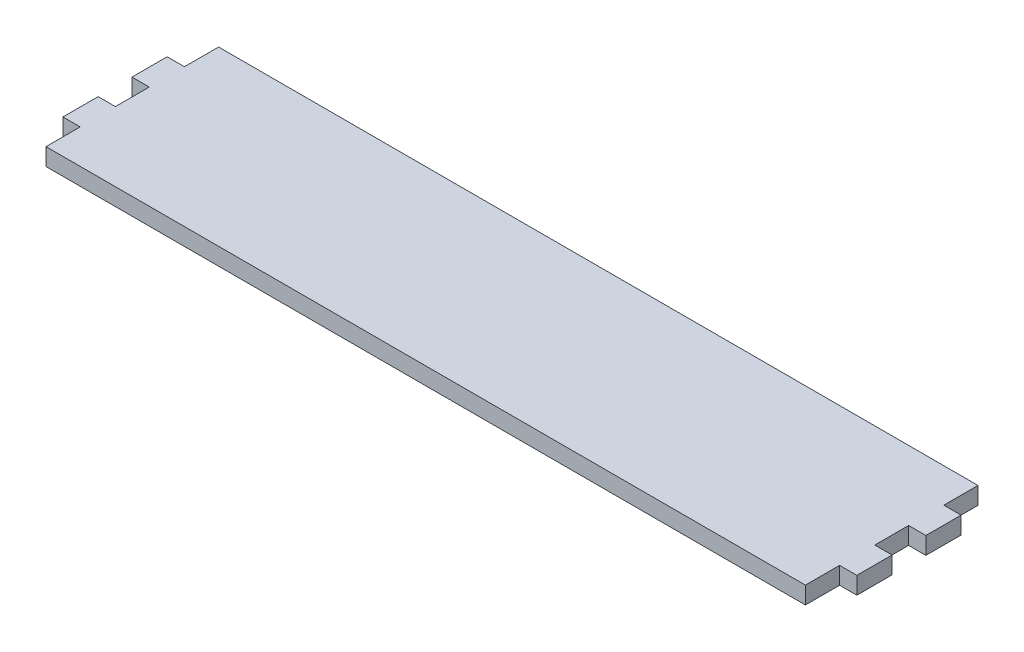
ISO-10303-21;
HEADER;
FILE_DESCRIPTION(('STEP AP214'),'2;1');
FILE_NAME('part.step','',(''),(''),'','','');
FILE_SCHEMA(('AUTOMOTIVE_DESIGN { 1 0 10303 214 1 1 1 1 }'));
ENDSEC;
DATA;
#1=APPLICATION_CONTEXT('core data for automotive mechanical design processes');
#2=APPLICATION_PROTOCOL_DEFINITION('international standard','automotive_design',2000,#1);
#3=PRODUCT_CONTEXT('',#1,'mechanical');
#4=PRODUCT('Part','Part','',(#3));
#5=PRODUCT_RELATED_PRODUCT_CATEGORY('part','',(#4));
#6=PRODUCT_DEFINITION_FORMATION('','',#4);
#7=PRODUCT_DEFINITION_CONTEXT('part definition',#1,'design');
#8=PRODUCT_DEFINITION('design','',#6,#7);
#9=PRODUCT_DEFINITION_SHAPE('','',#8);
#10=(LENGTH_UNIT() NAMED_UNIT(*) SI_UNIT(.MILLI.,.METRE.));
#11=(NAMED_UNIT(*) PLANE_ANGLE_UNIT() SI_UNIT($,.RADIAN.));
#12=(NAMED_UNIT(*) SI_UNIT($,.STERADIAN.) SOLID_ANGLE_UNIT());
#13=UNCERTAINTY_MEASURE_WITH_UNIT(LENGTH_MEASURE(1.E-05),#10,'distance_accuracy_value','');
#14=(GEOMETRIC_REPRESENTATION_CONTEXT(3) GLOBAL_UNCERTAINTY_ASSIGNED_CONTEXT((#13)) GLOBAL_UNIT_ASSIGNED_CONTEXT((#10,
#11,#12)) REPRESENTATION_CONTEXT('',''));
#15=CARTESIAN_POINT('',(0.,0.,0.));
#16=DIRECTION('',(0.,0.,1.));
#17=DIRECTION('',(1.,0.,0.));
#18=AXIS2_PLACEMENT_3D('',#15,#16,#17);
#19=CARTESIAN_POINT('',(0.,6.35,12.573));
#20=DIRECTION('',(1.,0.,0.));
#21=DIRECTION('',(0.,0.,-1.));
#22=AXIS2_PLACEMENT_3D('',#19,#20,#21);
#23=PLANE('',#22);
#24=DIRECTION('',(0.,0.,1.));
#25=VECTOR('',#24,1.);
#26=CARTESIAN_POINT('',(0.,0.,12.573));
#27=LINE('',#26,#25);
#28=CARTESIAN_POINT('',(0.,0.,0.));
#29=VERTEX_POINT('',#28);
#30=CARTESIAN_POINT('',(0.,0.,12.573));
#31=VERTEX_POINT('',#30);
#32=EDGE_CURVE('E203',#29,#31,#27,.T.);
#33=ORIENTED_EDGE('',*,*,#32,.T.);
#34=DIRECTION('',(0.,-1.,0.));
#35=VECTOR('',#34,1.);
#36=CARTESIAN_POINT('',(0.,6.35,12.573));
#37=LINE('',#36,#35);
#38=CARTESIAN_POINT('',(0.,6.35,12.573));
#39=VERTEX_POINT('',#38);
#40=EDGE_CURVE('E11',#39,#31,#37,.T.);
#41=ORIENTED_EDGE('',*,*,#40,.F.);
#42=DIRECTION('',(0.,0.,1.));
#43=VECTOR('',#42,1.);
#44=CARTESIAN_POINT('',(0.,6.35,12.573));
#45=LINE('',#44,#43);
#46=CARTESIAN_POINT('',(0.,6.35,0.));
#47=VERTEX_POINT('',#46);
#48=EDGE_CURVE('E241',#47,#39,#45,.T.);
#49=ORIENTED_EDGE('',*,*,#48,.F.);
#50=DIRECTION('',(0.,-1.,0.));
#51=VECTOR('',#50,1.);
#52=CARTESIAN_POINT('',(0.,6.35,0.));
#53=LINE('',#52,#51);
#54=EDGE_CURVE('E199',#47,#29,#53,.T.);
#55=ORIENTED_EDGE('',*,*,#54,.T.);
#56=EDGE_LOOP('',(#33,#41,#49,#55));
#57=FACE_BOUND('',#56,.T.);
#58=ADVANCED_FACE('F35',(#57),#23,.F.);
#59=CARTESIAN_POINT('',(-6.35000000000008,6.35,12.573));
#60=DIRECTION('',(0.,0.,1.));
#61=DIRECTION('',(1.,0.,0.));
#62=AXIS2_PLACEMENT_3D('',#59,#60,#61);
#63=PLANE('',#62);
#64=DIRECTION('',(-1.,0.,0.));
#65=VECTOR('',#64,1.);
#66=CARTESIAN_POINT('',(-6.35000000000008,0.,12.573));
#67=LINE('',#66,#65);
#68=CARTESIAN_POINT('',(-6.35000000000008,0.,12.573));
#69=VERTEX_POINT('',#68);
#70=EDGE_CURVE('E206',#31,#69,#67,.T.);
#71=ORIENTED_EDGE('',*,*,#70,.T.);
#72=DIRECTION('',(0.,-1.,0.));
#73=VECTOR('',#72,1.);
#74=CARTESIAN_POINT('',(-6.35000000000008,6.35,12.573));
#75=LINE('',#74,#73);
#76=CARTESIAN_POINT('',(-6.35000000000008,6.35,12.573));
#77=VERTEX_POINT('',#76);
#78=EDGE_CURVE('E43',#77,#69,#75,.T.);
#79=ORIENTED_EDGE('',*,*,#78,.F.);
#80=DIRECTION('',(-1.,0.,0.));
#81=VECTOR('',#80,1.);
#82=CARTESIAN_POINT('',(-6.35000000000008,6.35,12.573));
#83=LINE('',#82,#81);
#84=EDGE_CURVE('E130',#39,#77,#83,.T.);
#85=ORIENTED_EDGE('',*,*,#84,.F.);
#86=ORIENTED_EDGE('',*,*,#40,.T.);
#87=EDGE_LOOP('',(#71,#79,#85,#86));
#88=FACE_BOUND('',#87,.T.);
#89=ADVANCED_FACE('F359',(#88),#63,.F.);
#90=CARTESIAN_POINT('',(-6.35000000000003,6.35,25.527));
#91=DIRECTION('',(1.,0.,0.));
#92=DIRECTION('',(0.,0.,-1.));
#93=AXIS2_PLACEMENT_3D('',#90,#91,#92);
#94=PLANE('',#93);
#95=DIRECTION('',(0.,0.,1.));
#96=VECTOR('',#95,1.);
#97=CARTESIAN_POINT('',(-6.35000000000003,0.,25.527));
#98=LINE('',#97,#96);
#99=CARTESIAN_POINT('',(-6.35000000000003,0.,25.527));
#100=VERTEX_POINT('',#99);
#101=EDGE_CURVE('E208',#69,#100,#98,.T.);
#102=ORIENTED_EDGE('',*,*,#101,.T.);
#103=DIRECTION('',(0.,-1.,0.));
#104=VECTOR('',#103,1.);
#105=CARTESIAN_POINT('',(-6.35000000000003,6.35,25.527));
#106=LINE('',#105,#104);
#107=CARTESIAN_POINT('',(-6.35000000000003,6.35,25.527));
#108=VERTEX_POINT('',#107);
#109=EDGE_CURVE('E284',#108,#100,#106,.T.);
#110=ORIENTED_EDGE('',*,*,#109,.F.);
#111=DIRECTION('',(0.,0.,1.));
#112=VECTOR('',#111,1.);
#113=CARTESIAN_POINT('',(-6.35000000000003,6.35,25.527));
#114=LINE('',#113,#112);
#115=EDGE_CURVE('E292',#77,#108,#114,.T.);
#116=ORIENTED_EDGE('',*,*,#115,.F.);
#117=ORIENTED_EDGE('',*,*,#78,.T.);
#118=EDGE_LOOP('',(#102,#110,#116,#117));
#119=FACE_BOUND('',#118,.T.);
#120=ADVANCED_FACE('F290',(#119),#94,.F.);
#121=CARTESIAN_POINT('',(0.,6.35,25.527));
#122=DIRECTION('',(0.,0.,-1.));
#123=DIRECTION('',(-1.,0.,0.));
#124=AXIS2_PLACEMENT_3D('',#121,#122,#123);
#125=PLANE('',#124);
#126=DIRECTION('',(1.,0.,0.));
#127=VECTOR('',#126,1.);
#128=CARTESIAN_POINT('',(0.,0.,25.527));
#129=LINE('',#128,#127);
#130=CARTESIAN_POINT('',(0.,0.,25.527));
#131=VERTEX_POINT('',#130);
#132=EDGE_CURVE('E210',#100,#131,#129,.T.);
#133=ORIENTED_EDGE('',*,*,#132,.T.);
#134=DIRECTION('',(0.,-1.,0.));
#135=VECTOR('',#134,1.);
#136=CARTESIAN_POINT('',(0.,6.35,25.527));
#137=LINE('',#136,#135);
#138=CARTESIAN_POINT('',(0.,6.35,25.527));
#139=VERTEX_POINT('',#138);
#140=EDGE_CURVE('E281',#139,#131,#137,.T.);
#141=ORIENTED_EDGE('',*,*,#140,.F.);
#142=DIRECTION('',(1.,0.,0.));
#143=VECTOR('',#142,1.);
#144=CARTESIAN_POINT('',(0.,6.35,25.527));
#145=LINE('',#144,#143);
#146=EDGE_CURVE('E310',#108,#139,#145,.T.);
#147=ORIENTED_EDGE('',*,*,#146,.F.);
#148=ORIENTED_EDGE('',*,*,#109,.T.);
#149=EDGE_LOOP('',(#133,#141,#147,#148));
#150=FACE_BOUND('',#149,.T.);
#151=ADVANCED_FACE('F301',(#150),#125,.F.);
#152=CARTESIAN_POINT('',(0.,6.35,37.973));
#153=DIRECTION('',(1.,0.,0.));
#154=DIRECTION('',(0.,0.,-1.));
#155=AXIS2_PLACEMENT_3D('',#152,#153,#154);
#156=PLANE('',#155);
#157=DIRECTION('',(0.,0.,1.));
#158=VECTOR('',#157,1.);
#159=CARTESIAN_POINT('',(0.,0.,37.973));
#160=LINE('',#159,#158);
#161=CARTESIAN_POINT('',(0.,0.,37.973));
#162=VERTEX_POINT('',#161);
#163=EDGE_CURVE('E212',#131,#162,#160,.T.);
#164=ORIENTED_EDGE('',*,*,#163,.T.);
#165=DIRECTION('',(0.,-1.,0.));
#166=VECTOR('',#165,1.);
#167=CARTESIAN_POINT('',(0.,6.35,37.973));
#168=LINE('',#167,#166);
#169=CARTESIAN_POINT('',(0.,6.35,37.973));
#170=VERTEX_POINT('',#169);
#171=EDGE_CURVE('E278',#170,#162,#168,.T.);
#172=ORIENTED_EDGE('',*,*,#171,.F.);
#173=DIRECTION('',(0.,0.,1.));
#174=VECTOR('',#173,1.);
#175=CARTESIAN_POINT('',(0.,6.35,37.973));
#176=LINE('',#175,#174);
#177=EDGE_CURVE('E307',#139,#170,#176,.T.);
#178=ORIENTED_EDGE('',*,*,#177,.F.);
#179=ORIENTED_EDGE('',*,*,#140,.T.);
#180=EDGE_LOOP('',(#164,#172,#178,#179));
#181=FACE_BOUND('',#180,.T.);
#182=ADVANCED_FACE('F305',(#181),#156,.F.);
#183=CARTESIAN_POINT('',(-6.35000000000008,6.35,37.973));
#184=DIRECTION('',(0.,0.,1.));
#185=DIRECTION('',(1.,0.,0.));
#186=AXIS2_PLACEMENT_3D('',#183,#184,#185);
#187=PLANE('',#186);
#188=DIRECTION('',(-1.,0.,0.));
#189=VECTOR('',#188,1.);
#190=CARTESIAN_POINT('',(-6.35000000000008,0.,37.973));
#191=LINE('',#190,#189);
#192=CARTESIAN_POINT('',(-6.35000000000008,0.,37.973));
#193=VERTEX_POINT('',#192);
#194=EDGE_CURVE('E214',#162,#193,#191,.T.);
#195=ORIENTED_EDGE('',*,*,#194,.T.);
#196=DIRECTION('',(0.,-1.,0.));
#197=VECTOR('',#196,1.);
#198=CARTESIAN_POINT('',(-6.35000000000008,6.35,37.973));
#199=LINE('',#198,#197);
#200=CARTESIAN_POINT('',(-6.35000000000008,6.35,37.973));
#201=VERTEX_POINT('',#200);
#202=EDGE_CURVE('E275',#201,#193,#199,.T.);
#203=ORIENTED_EDGE('',*,*,#202,.F.);
#204=DIRECTION('',(-1.,0.,0.));
#205=VECTOR('',#204,1.);
#206=CARTESIAN_POINT('',(-6.35000000000008,6.35,37.973));
#207=LINE('',#206,#205);
#208=EDGE_CURVE('E309',#170,#201,#207,.T.);
#209=ORIENTED_EDGE('',*,*,#208,.F.);
#210=ORIENTED_EDGE('',*,*,#171,.T.);
#211=EDGE_LOOP('',(#195,#203,#209,#210));
#212=FACE_BOUND('',#211,.T.);
#213=ADVANCED_FACE('F372',(#212),#187,.F.);
#214=CARTESIAN_POINT('',(-6.35000000000003,6.35,50.927));
#215=DIRECTION('',(1.,0.,0.));
#216=DIRECTION('',(0.,0.,-1.));
#217=AXIS2_PLACEMENT_3D('',#214,#215,#216);
#218=PLANE('',#217);
#219=DIRECTION('',(0.,0.,1.));
#220=VECTOR('',#219,1.);
#221=CARTESIAN_POINT('',(-6.35000000000003,0.,50.927));
#222=LINE('',#221,#220);
#223=CARTESIAN_POINT('',(-6.35000000000003,0.,50.927));
#224=VERTEX_POINT('',#223);
#225=EDGE_CURVE('E216',#193,#224,#222,.T.);
#226=ORIENTED_EDGE('',*,*,#225,.T.);
#227=DIRECTION('',(0.,-1.,0.));
#228=VECTOR('',#227,1.);
#229=CARTESIAN_POINT('',(-6.35000000000003,6.35,50.927));
#230=LINE('',#229,#228);
#231=CARTESIAN_POINT('',(-6.35000000000003,6.35,50.927));
#232=VERTEX_POINT('',#231);
#233=EDGE_CURVE('E272',#232,#224,#230,.T.);
#234=ORIENTED_EDGE('',*,*,#233,.F.);
#235=DIRECTION('',(0.,0.,1.));
#236=VECTOR('',#235,1.);
#237=CARTESIAN_POINT('',(-6.35000000000003,6.35,50.927));
#238=LINE('',#237,#236);
#239=EDGE_CURVE('E312',#201,#232,#238,.T.);
#240=ORIENTED_EDGE('',*,*,#239,.F.);
#241=ORIENTED_EDGE('',*,*,#202,.T.);
#242=EDGE_LOOP('',(#226,#234,#240,#241));
#243=FACE_BOUND('',#242,.T.);
#244=ADVANCED_FACE('F375',(#243),#218,.F.);
#245=CARTESIAN_POINT('',(0.,6.35,50.927));
#246=DIRECTION('',(0.,0.,-1.));
#247=DIRECTION('',(-1.,0.,0.));
#248=AXIS2_PLACEMENT_3D('',#245,#246,#247);
#249=PLANE('',#248);
#250=DIRECTION('',(1.,0.,0.));
#251=VECTOR('',#250,1.);
#252=CARTESIAN_POINT('',(0.,0.,50.927));
#253=LINE('',#252,#251);
#254=CARTESIAN_POINT('',(0.,0.,50.927));
#255=VERTEX_POINT('',#254);
#256=EDGE_CURVE('E218',#224,#255,#253,.T.);
#257=ORIENTED_EDGE('',*,*,#256,.T.);
#258=DIRECTION('',(0.,-1.,0.));
#259=VECTOR('',#258,1.);
#260=CARTESIAN_POINT('',(0.,6.35,50.927));
#261=LINE('',#260,#259);
#262=CARTESIAN_POINT('',(0.,6.35,50.927));
#263=VERTEX_POINT('',#262);
#264=EDGE_CURVE('E269',#263,#255,#261,.T.);
#265=ORIENTED_EDGE('',*,*,#264,.F.);
#266=DIRECTION('',(1.,0.,0.));
#267=VECTOR('',#266,1.);
#268=CARTESIAN_POINT('',(0.,6.35,50.927));
#269=LINE('',#268,#267);
#270=EDGE_CURVE('E318',#232,#263,#269,.T.);
#271=ORIENTED_EDGE('',*,*,#270,.F.);
#272=ORIENTED_EDGE('',*,*,#233,.T.);
#273=EDGE_LOOP('',(#257,#265,#271,#272));
#274=FACE_BOUND('',#273,.T.);
#275=ADVANCED_FACE('F379',(#274),#249,.F.);
#276=CARTESIAN_POINT('',(0.,6.35,63.5));
#277=DIRECTION('',(1.,0.,0.));
#278=DIRECTION('',(0.,0.,-1.));
#279=AXIS2_PLACEMENT_3D('',#276,#277,#278);
#280=PLANE('',#279);
#281=DIRECTION('',(0.,0.,1.));
#282=VECTOR('',#281,1.);
#283=CARTESIAN_POINT('',(0.,0.,63.5));
#284=LINE('',#283,#282);
#285=CARTESIAN_POINT('',(0.,0.,63.5));
#286=VERTEX_POINT('',#285);
#287=EDGE_CURVE('E220',#255,#286,#284,.T.);
#288=ORIENTED_EDGE('',*,*,#287,.T.);
#289=DIRECTION('',(0.,-1.,0.));
#290=VECTOR('',#289,1.);
#291=CARTESIAN_POINT('',(0.,6.35,63.5));
#292=LINE('',#291,#290);
#293=CARTESIAN_POINT('',(0.,6.35,63.5));
#294=VERTEX_POINT('',#293);
#295=EDGE_CURVE('E266',#294,#286,#292,.T.);
#296=ORIENTED_EDGE('',*,*,#295,.F.);
#297=DIRECTION('',(0.,0.,1.));
#298=VECTOR('',#297,1.);
#299=CARTESIAN_POINT('',(0.,6.35,63.5));
#300=LINE('',#299,#298);
#301=EDGE_CURVE('E320',#263,#294,#300,.T.);
#302=ORIENTED_EDGE('',*,*,#301,.F.);
#303=ORIENTED_EDGE('',*,*,#264,.T.);
#304=EDGE_LOOP('',(#288,#296,#302,#303));
#305=FACE_BOUND('',#304,.T.);
#306=ADVANCED_FACE('F383',(#305),#280,.F.);
#307=CARTESIAN_POINT('',(279.4,6.35,63.5));
#308=DIRECTION('',(0.,0.,-1.));
#309=DIRECTION('',(-1.,0.,0.));
#310=AXIS2_PLACEMENT_3D('',#307,#308,#309);
#311=PLANE('',#310);
#312=DIRECTION('',(1.,0.,0.));
#313=VECTOR('',#312,1.);
#314=CARTESIAN_POINT('',(279.4,0.,63.5));
#315=LINE('',#314,#313);
#316=CARTESIAN_POINT('',(279.4,0.,63.5));
#317=VERTEX_POINT('',#316);
#318=EDGE_CURVE('E222',#286,#317,#315,.T.);
#319=ORIENTED_EDGE('',*,*,#318,.T.);
#320=DIRECTION('',(0.,-1.,0.));
#321=VECTOR('',#320,1.);
#322=CARTESIAN_POINT('',(279.4,6.35,63.5));
#323=LINE('',#322,#321);
#324=CARTESIAN_POINT('',(279.4,6.35,63.5));
#325=VERTEX_POINT('',#324);
#326=EDGE_CURVE('E263',#325,#317,#323,.T.);
#327=ORIENTED_EDGE('',*,*,#326,.F.);
#328=DIRECTION('',(1.,0.,0.));
#329=VECTOR('',#328,1.);
#330=CARTESIAN_POINT('',(279.4,6.35,63.5));
#331=LINE('',#330,#329);
#332=EDGE_CURVE('E322',#294,#325,#331,.T.);
#333=ORIENTED_EDGE('',*,*,#332,.F.);
#334=ORIENTED_EDGE('',*,*,#295,.T.);
#335=EDGE_LOOP('',(#319,#327,#333,#334));
#336=FACE_BOUND('',#335,.T.);
#337=ADVANCED_FACE('F387',(#336),#311,.F.);
#338=CARTESIAN_POINT('',(279.4,6.35,50.927));
#339=DIRECTION('',(-1.,0.,0.));
#340=DIRECTION('',(0.,0.,1.));
#341=AXIS2_PLACEMENT_3D('',#338,#339,#340);
#342=PLANE('',#341);
#343=DIRECTION('',(0.,0.,-1.));
#344=VECTOR('',#343,1.);
#345=CARTESIAN_POINT('',(279.4,0.,50.927));
#346=LINE('',#345,#344);
#347=CARTESIAN_POINT('',(279.4,0.,50.927));
#348=VERTEX_POINT('',#347);
#349=EDGE_CURVE('E224',#317,#348,#346,.T.);
#350=ORIENTED_EDGE('',*,*,#349,.T.);
#351=DIRECTION('',(0.,-1.,0.));
#352=VECTOR('',#351,1.);
#353=CARTESIAN_POINT('',(279.4,6.35,50.927));
#354=LINE('',#353,#352);
#355=CARTESIAN_POINT('',(279.4,6.35,50.927));
#356=VERTEX_POINT('',#355);
#357=EDGE_CURVE('E260',#356,#348,#354,.T.);
#358=ORIENTED_EDGE('',*,*,#357,.F.);
#359=DIRECTION('',(0.,0.,-1.));
#360=VECTOR('',#359,1.);
#361=CARTESIAN_POINT('',(279.4,6.35,50.927));
#362=LINE('',#361,#360);
#363=EDGE_CURVE('E324',#325,#356,#362,.T.);
#364=ORIENTED_EDGE('',*,*,#363,.F.);
#365=ORIENTED_EDGE('',*,*,#326,.T.);
#366=EDGE_LOOP('',(#350,#358,#364,#365));
#367=FACE_BOUND('',#366,.T.);
#368=ADVANCED_FACE('F391',(#367),#342,.F.);
#369=CARTESIAN_POINT('',(285.75,6.35,50.927));
#370=DIRECTION('',(0.,0.,-1.));
#371=DIRECTION('',(-1.,0.,0.));
#372=AXIS2_PLACEMENT_3D('',#369,#370,#371);
#373=PLANE('',#372);
#374=DIRECTION('',(1.,0.,0.));
#375=VECTOR('',#374,1.);
#376=CARTESIAN_POINT('',(285.75,0.,50.927));
#377=LINE('',#376,#375);
#378=CARTESIAN_POINT('',(285.75,0.,50.927));
#379=VERTEX_POINT('',#378);
#380=EDGE_CURVE('E226',#348,#379,#377,.T.);
#381=ORIENTED_EDGE('',*,*,#380,.T.);
#382=DIRECTION('',(0.,-1.,0.));
#383=VECTOR('',#382,1.);
#384=CARTESIAN_POINT('',(285.75,6.35,50.927));
#385=LINE('',#384,#383);
#386=CARTESIAN_POINT('',(285.75,6.35,50.927));
#387=VERTEX_POINT('',#386);
#388=EDGE_CURVE('E257',#387,#379,#385,.T.);
#389=ORIENTED_EDGE('',*,*,#388,.F.);
#390=DIRECTION('',(1.,0.,0.));
#391=VECTOR('',#390,1.);
#392=CARTESIAN_POINT('',(285.75,6.35,50.927));
#393=LINE('',#392,#391);
#394=EDGE_CURVE('E326',#356,#387,#393,.T.);
#395=ORIENTED_EDGE('',*,*,#394,.F.);
#396=ORIENTED_EDGE('',*,*,#357,.T.);
#397=EDGE_LOOP('',(#381,#389,#395,#396));
#398=FACE_BOUND('',#397,.T.);
#399=ADVANCED_FACE('F395',(#398),#373,.F.);
#400=CARTESIAN_POINT('',(285.75,6.35,37.973));
#401=DIRECTION('',(-1.,0.,0.));
#402=DIRECTION('',(0.,0.,1.));
#403=AXIS2_PLACEMENT_3D('',#400,#401,#402);
#404=PLANE('',#403);
#405=DIRECTION('',(0.,0.,-1.));
#406=VECTOR('',#405,1.);
#407=CARTESIAN_POINT('',(285.75,0.,37.973));
#408=LINE('',#407,#406);
#409=CARTESIAN_POINT('',(285.75,0.,37.973));
#410=VERTEX_POINT('',#409);
#411=EDGE_CURVE('E228',#379,#410,#408,.T.);
#412=ORIENTED_EDGE('',*,*,#411,.T.);
#413=DIRECTION('',(0.,-1.,0.));
#414=VECTOR('',#413,1.);
#415=CARTESIAN_POINT('',(285.75,6.35,37.973));
#416=LINE('',#415,#414);
#417=CARTESIAN_POINT('',(285.75,6.35,37.973));
#418=VERTEX_POINT('',#417);
#419=EDGE_CURVE('E254',#418,#410,#416,.T.);
#420=ORIENTED_EDGE('',*,*,#419,.F.);
#421=DIRECTION('',(0.,0.,-1.));
#422=VECTOR('',#421,1.);
#423=CARTESIAN_POINT('',(285.75,6.35,37.973));
#424=LINE('',#423,#422);
#425=EDGE_CURVE('E328',#387,#418,#424,.T.);
#426=ORIENTED_EDGE('',*,*,#425,.F.);
#427=ORIENTED_EDGE('',*,*,#388,.T.);
#428=EDGE_LOOP('',(#412,#420,#426,#427));
#429=FACE_BOUND('',#428,.T.);
#430=ADVANCED_FACE('F399',(#429),#404,.F.);
#431=CARTESIAN_POINT('',(279.4,6.35,37.973));
#432=DIRECTION('',(0.,0.,1.));
#433=DIRECTION('',(1.,0.,0.));
#434=AXIS2_PLACEMENT_3D('',#431,#432,#433);
#435=PLANE('',#434);
#436=DIRECTION('',(-1.,0.,0.));
#437=VECTOR('',#436,1.);
#438=CARTESIAN_POINT('',(279.4,0.,37.973));
#439=LINE('',#438,#437);
#440=CARTESIAN_POINT('',(279.4,0.,37.973));
#441=VERTEX_POINT('',#440);
#442=EDGE_CURVE('E230',#410,#441,#439,.T.);
#443=ORIENTED_EDGE('',*,*,#442,.T.);
#444=DIRECTION('',(0.,-1.,0.));
#445=VECTOR('',#444,1.);
#446=CARTESIAN_POINT('',(279.4,6.35,37.973));
#447=LINE('',#446,#445);
#448=CARTESIAN_POINT('',(279.4,6.35,37.973));
#449=VERTEX_POINT('',#448);
#450=EDGE_CURVE('E251',#449,#441,#447,.T.);
#451=ORIENTED_EDGE('',*,*,#450,.F.);
#452=DIRECTION('',(-1.,0.,0.));
#453=VECTOR('',#452,1.);
#454=CARTESIAN_POINT('',(279.4,6.35,37.973));
#455=LINE('',#454,#453);
#456=EDGE_CURVE('E330',#418,#449,#455,.T.);
#457=ORIENTED_EDGE('',*,*,#456,.F.);
#458=ORIENTED_EDGE('',*,*,#419,.T.);
#459=EDGE_LOOP('',(#443,#451,#457,#458));
#460=FACE_BOUND('',#459,.T.);
#461=ADVANCED_FACE('F403',(#460),#435,.F.);
#462=CARTESIAN_POINT('',(279.4,6.35,25.527));
#463=DIRECTION('',(-1.,0.,0.));
#464=DIRECTION('',(0.,0.,1.));
#465=AXIS2_PLACEMENT_3D('',#462,#463,#464);
#466=PLANE('',#465);
#467=DIRECTION('',(0.,0.,-1.));
#468=VECTOR('',#467,1.);
#469=CARTESIAN_POINT('',(279.4,0.,25.527));
#470=LINE('',#469,#468);
#471=CARTESIAN_POINT('',(279.4,0.,25.527));
#472=VERTEX_POINT('',#471);
#473=EDGE_CURVE('E232',#441,#472,#470,.T.);
#474=ORIENTED_EDGE('',*,*,#473,.T.);
#475=DIRECTION('',(0.,-1.,0.));
#476=VECTOR('',#475,1.);
#477=CARTESIAN_POINT('',(279.4,6.35,25.527));
#478=LINE('',#477,#476);
#479=CARTESIAN_POINT('',(279.4,6.35,25.527));
#480=VERTEX_POINT('',#479);
#481=EDGE_CURVE('E248',#480,#472,#478,.T.);
#482=ORIENTED_EDGE('',*,*,#481,.F.);
#483=DIRECTION('',(0.,0.,-1.));
#484=VECTOR('',#483,1.);
#485=CARTESIAN_POINT('',(279.4,6.35,25.527));
#486=LINE('',#485,#484);
#487=EDGE_CURVE('E332',#449,#480,#486,.T.);
#488=ORIENTED_EDGE('',*,*,#487,.F.);
#489=ORIENTED_EDGE('',*,*,#450,.T.);
#490=EDGE_LOOP('',(#474,#482,#488,#489));
#491=FACE_BOUND('',#490,.T.);
#492=ADVANCED_FACE('F407',(#491),#466,.F.);
#493=CARTESIAN_POINT('',(285.75,6.35,25.527));
#494=DIRECTION('',(0.,0.,-1.));
#495=DIRECTION('',(-1.,0.,0.));
#496=AXIS2_PLACEMENT_3D('',#493,#494,#495);
#497=PLANE('',#496);
#498=DIRECTION('',(1.,0.,0.));
#499=VECTOR('',#498,1.);
#500=CARTESIAN_POINT('',(285.75,0.,25.527));
#501=LINE('',#500,#499);
#502=CARTESIAN_POINT('',(285.75,0.,25.527));
#503=VERTEX_POINT('',#502);
#504=EDGE_CURVE('E234',#472,#503,#501,.T.);
#505=ORIENTED_EDGE('',*,*,#504,.T.);
#506=DIRECTION('',(0.,-1.,0.));
#507=VECTOR('',#506,1.);
#508=CARTESIAN_POINT('',(285.75,6.35,25.527));
#509=LINE('',#508,#507);
#510=CARTESIAN_POINT('',(285.75,6.35,25.527));
#511=VERTEX_POINT('',#510);
#512=EDGE_CURVE('E245',#511,#503,#509,.T.);
#513=ORIENTED_EDGE('',*,*,#512,.F.);
#514=DIRECTION('',(1.,0.,0.));
#515=VECTOR('',#514,1.);
#516=CARTESIAN_POINT('',(285.75,6.35,25.527));
#517=LINE('',#516,#515);
#518=EDGE_CURVE('E334',#480,#511,#517,.T.);
#519=ORIENTED_EDGE('',*,*,#518,.F.);
#520=ORIENTED_EDGE('',*,*,#481,.T.);
#521=EDGE_LOOP('',(#505,#513,#519,#520));
#522=FACE_BOUND('',#521,.T.);
#523=ADVANCED_FACE('F340',(#522),#497,.F.);
#524=CARTESIAN_POINT('',(285.75,6.35,12.573));
#525=DIRECTION('',(-1.,0.,0.));
#526=DIRECTION('',(0.,0.,1.));
#527=AXIS2_PLACEMENT_3D('',#524,#525,#526);
#528=PLANE('',#527);
#529=DIRECTION('',(0.,0.,-1.));
#530=VECTOR('',#529,1.);
#531=CARTESIAN_POINT('',(285.75,0.,12.573));
#532=LINE('',#531,#530);
#533=CARTESIAN_POINT('',(285.75,0.,12.573));
#534=VERTEX_POINT('',#533);
#535=EDGE_CURVE('E236',#503,#534,#532,.T.);
#536=ORIENTED_EDGE('',*,*,#535,.T.);
#537=DIRECTION('',(0.,-1.,0.));
#538=VECTOR('',#537,1.);
#539=CARTESIAN_POINT('',(285.75,6.35,12.573));
#540=LINE('',#539,#538);
#541=CARTESIAN_POINT('',(285.75,6.35,12.573));
#542=VERTEX_POINT('',#541);
#543=EDGE_CURVE('E194',#542,#534,#540,.T.);
#544=ORIENTED_EDGE('',*,*,#543,.F.);
#545=DIRECTION('',(0.,0.,-1.));
#546=VECTOR('',#545,1.);
#547=CARTESIAN_POINT('',(285.75,6.35,12.573));
#548=LINE('',#547,#546);
#549=EDGE_CURVE('E185',#511,#542,#548,.T.);
#550=ORIENTED_EDGE('',*,*,#549,.F.);
#551=ORIENTED_EDGE('',*,*,#512,.T.);
#552=EDGE_LOOP('',(#536,#544,#550,#551));
#553=FACE_BOUND('',#552,.T.);
#554=ADVANCED_FACE('F344',(#553),#528,.F.);
#555=CARTESIAN_POINT('',(279.4,6.35,12.573));
#556=DIRECTION('',(0.,0.,1.));
#557=DIRECTION('',(1.,0.,0.));
#558=AXIS2_PLACEMENT_3D('',#555,#556,#557);
#559=PLANE('',#558);
#560=DIRECTION('',(-1.,0.,0.));
#561=VECTOR('',#560,1.);
#562=CARTESIAN_POINT('',(279.4,0.,12.573));
#563=LINE('',#562,#561);
#564=CARTESIAN_POINT('',(279.4,0.,12.573));
#565=VERTEX_POINT('',#564);
#566=EDGE_CURVE('E193',#534,#565,#563,.T.);
#567=ORIENTED_EDGE('',*,*,#566,.T.);
#568=DIRECTION('',(0.,-1.,0.));
#569=VECTOR('',#568,1.);
#570=CARTESIAN_POINT('',(279.4,6.35,12.573));
#571=LINE('',#570,#569);
#572=CARTESIAN_POINT('',(279.4,6.35,12.573));
#573=VERTEX_POINT('',#572);
#574=EDGE_CURVE('E190',#573,#565,#571,.T.);
#575=ORIENTED_EDGE('',*,*,#574,.F.);
#576=DIRECTION('',(-1.,0.,0.));
#577=VECTOR('',#576,1.);
#578=CARTESIAN_POINT('',(279.4,6.35,12.573));
#579=LINE('',#578,#577);
#580=EDGE_CURVE('E179',#542,#573,#579,.T.);
#581=ORIENTED_EDGE('',*,*,#580,.F.);
#582=ORIENTED_EDGE('',*,*,#543,.T.);
#583=EDGE_LOOP('',(#567,#575,#581,#582));
#584=FACE_BOUND('',#583,.T.);
#585=ADVANCED_FACE('F191',(#584),#559,.F.);
#586=CARTESIAN_POINT('',(279.4,6.35,0.));
#587=DIRECTION('',(-1.,0.,0.));
#588=DIRECTION('',(0.,0.,1.));
#589=AXIS2_PLACEMENT_3D('',#586,#587,#588);
#590=PLANE('',#589);
#591=DIRECTION('',(0.,0.,-1.));
#592=VECTOR('',#591,1.);
#593=CARTESIAN_POINT('',(279.4,0.,0.));
#594=LINE('',#593,#592);
#595=CARTESIAN_POINT('',(279.4,0.,0.));
#596=VERTEX_POINT('',#595);
#597=EDGE_CURVE('E116',#565,#596,#594,.T.);
#598=ORIENTED_EDGE('',*,*,#597,.T.);
#599=DIRECTION('',(0.,-1.,0.));
#600=VECTOR('',#599,1.);
#601=CARTESIAN_POINT('',(279.4,6.35,0.));
#602=LINE('',#601,#600);
#603=CARTESIAN_POINT('',(279.4,6.35,0.));
#604=VERTEX_POINT('',#603);
#605=EDGE_CURVE('E195',#604,#596,#602,.T.);
#606=ORIENTED_EDGE('',*,*,#605,.F.);
#607=DIRECTION('',(0.,0.,-1.));
#608=VECTOR('',#607,1.);
#609=CARTESIAN_POINT('',(279.4,6.35,0.));
#610=LINE('',#609,#608);
#611=EDGE_CURVE('E183',#573,#604,#610,.T.);
#612=ORIENTED_EDGE('',*,*,#611,.F.);
#613=ORIENTED_EDGE('',*,*,#574,.T.);
#614=EDGE_LOOP('',(#598,#606,#612,#613));
#615=FACE_BOUND('',#614,.T.);
#616=ADVANCED_FACE('F197',(#615),#590,.F.);
#617=CARTESIAN_POINT('',(0.,6.35,0.));
#618=DIRECTION('',(0.,0.,1.));
#619=DIRECTION('',(1.,0.,0.));
#620=AXIS2_PLACEMENT_3D('',#617,#618,#619);
#621=PLANE('',#620);
#622=DIRECTION('',(-1.,0.,0.));
#623=VECTOR('',#622,1.);
#624=CARTESIAN_POINT('',(0.,0.,0.));
#625=LINE('',#624,#623);
#626=EDGE_CURVE('E122',#596,#29,#625,.T.);
#627=ORIENTED_EDGE('',*,*,#626,.T.);
#628=ORIENTED_EDGE('',*,*,#54,.F.);
#629=DIRECTION('',(-1.,0.,0.));
#630=VECTOR('',#629,1.);
#631=CARTESIAN_POINT('',(0.,6.35,0.));
#632=LINE('',#631,#630);
#633=EDGE_CURVE('E51',#604,#47,#632,.T.);
#634=ORIENTED_EDGE('',*,*,#633,.F.);
#635=ORIENTED_EDGE('',*,*,#605,.T.);
#636=EDGE_LOOP('',(#627,#628,#634,#635));
#637=FACE_BOUND('',#636,.T.);
#638=ADVANCED_FACE('F348',(#637),#621,.F.);
#639=CARTESIAN_POINT('',(0.,6.35,0.));
#640=DIRECTION('',(0.,-1.,0.));
#641=DIRECTION('',(0.,0.,-1.));
#642=AXIS2_PLACEMENT_3D('',#639,#640,#641);
#643=PLANE('',#642);
#644=ORIENTED_EDGE('',*,*,#48,.T.);
#645=ORIENTED_EDGE('',*,*,#84,.T.);
#646=ORIENTED_EDGE('',*,*,#115,.T.);
#647=ORIENTED_EDGE('',*,*,#146,.T.);
#648=ORIENTED_EDGE('',*,*,#177,.T.);
#649=ORIENTED_EDGE('',*,*,#208,.T.);
#650=ORIENTED_EDGE('',*,*,#239,.T.);
#651=ORIENTED_EDGE('',*,*,#270,.T.);
#652=ORIENTED_EDGE('',*,*,#301,.T.);
#653=ORIENTED_EDGE('',*,*,#332,.T.);
#654=ORIENTED_EDGE('',*,*,#363,.T.);
#655=ORIENTED_EDGE('',*,*,#394,.T.);
#656=ORIENTED_EDGE('',*,*,#425,.T.);
#657=ORIENTED_EDGE('',*,*,#456,.T.);
#658=ORIENTED_EDGE('',*,*,#487,.T.);
#659=ORIENTED_EDGE('',*,*,#518,.T.);
#660=ORIENTED_EDGE('',*,*,#549,.T.);
#661=ORIENTED_EDGE('',*,*,#580,.T.);
#662=ORIENTED_EDGE('',*,*,#611,.T.);
#663=ORIENTED_EDGE('',*,*,#633,.T.);
#664=EDGE_LOOP('',(#644,#645,#646,#647,#648,#649,#650,#651,#652,#653,#654,#655,#656,#657,#658,
#659,#660,#661,#662,#663));
#665=FACE_BOUND('',#664,.T.);
#666=ADVANCED_FACE('F181',(#665),#643,.F.);
#667=CARTESIAN_POINT('',(0.,0.,0.));
#668=DIRECTION('',(0.,-1.,0.));
#669=DIRECTION('',(0.,0.,-1.));
#670=AXIS2_PLACEMENT_3D('',#667,#668,#669);
#671=PLANE('',#670);
#672=ORIENTED_EDGE('',*,*,#32,.F.);
#673=ORIENTED_EDGE('',*,*,#626,.F.);
#674=ORIENTED_EDGE('',*,*,#597,.F.);
#675=ORIENTED_EDGE('',*,*,#566,.F.);
#676=ORIENTED_EDGE('',*,*,#535,.F.);
#677=ORIENTED_EDGE('',*,*,#504,.F.);
#678=ORIENTED_EDGE('',*,*,#473,.F.);
#679=ORIENTED_EDGE('',*,*,#442,.F.);
#680=ORIENTED_EDGE('',*,*,#411,.F.);
#681=ORIENTED_EDGE('',*,*,#380,.F.);
#682=ORIENTED_EDGE('',*,*,#349,.F.);
#683=ORIENTED_EDGE('',*,*,#318,.F.);
#684=ORIENTED_EDGE('',*,*,#287,.F.);
#685=ORIENTED_EDGE('',*,*,#256,.F.);
#686=ORIENTED_EDGE('',*,*,#225,.F.);
#687=ORIENTED_EDGE('',*,*,#194,.F.);
#688=ORIENTED_EDGE('',*,*,#163,.F.);
#689=ORIENTED_EDGE('',*,*,#132,.F.);
#690=ORIENTED_EDGE('',*,*,#101,.F.);
#691=ORIENTED_EDGE('',*,*,#70,.F.);
#692=EDGE_LOOP('',(#672,#673,#674,#675,#676,#677,#678,#679,#680,#681,#682,#683,#684,#685,#686,
#687,#688,#689,#690,#691));
#693=FACE_BOUND('',#692,.T.);
#694=ADVANCED_FACE('F296',(#693),#671,.T.);
#695=CLOSED_SHELL('',(#58,#89,#120,#151,#182,#213,#244,#275,#306,#337,#368,#399,#430,#461,#492,
#523,#554,#585,#616,#638,#666,#694));
#696=MANIFOLD_SOLID_BREP('B2',#695);
#697=ADVANCED_BREP_SHAPE_REPRESENTATION('',(#18,#696),#14);
#698=SHAPE_DEFINITION_REPRESENTATION(#9,#697);
ENDSEC;
END-ISO-10303-21;
